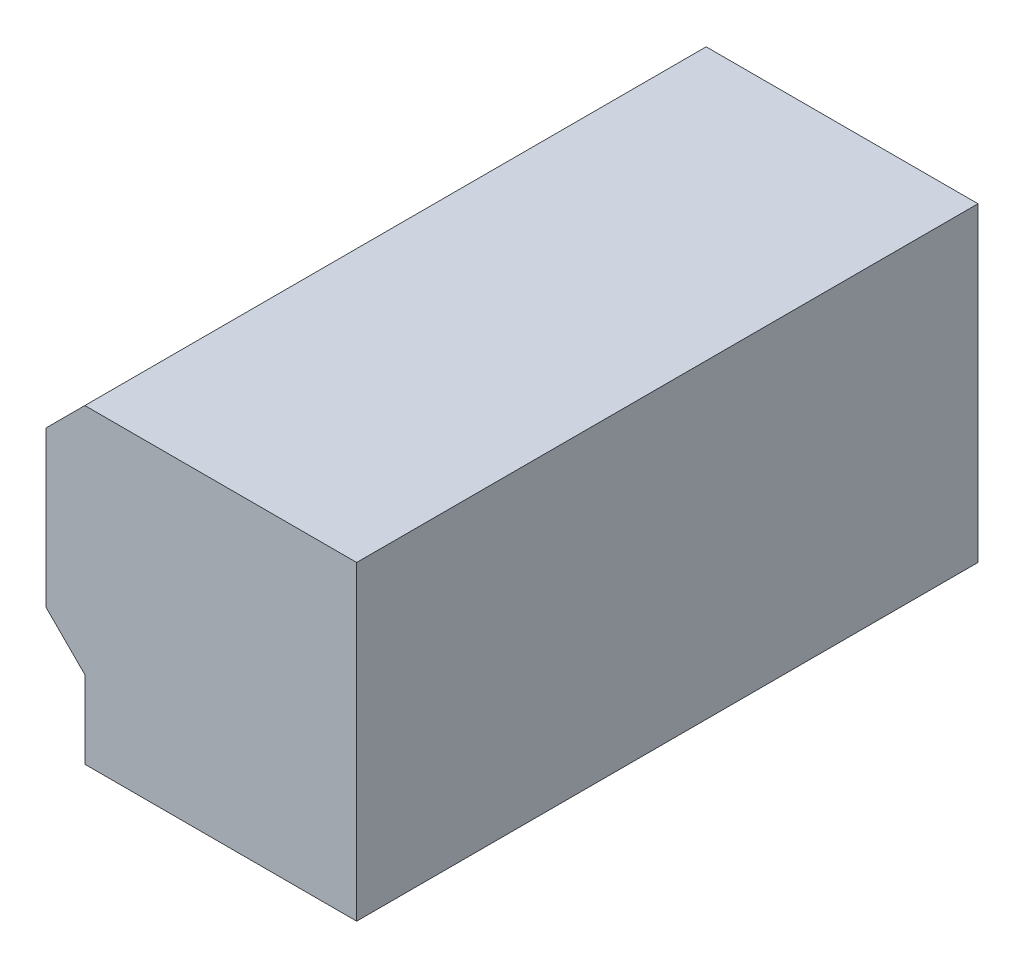
ISO-10303-21;
HEADER;
FILE_DESCRIPTION(('STEP AP214'),'2;1');
FILE_NAME('part.step','',(''),(''),'','','');
FILE_SCHEMA(('AUTOMOTIVE_DESIGN { 1 0 10303 214 1 1 1 1 }'));
ENDSEC;
DATA;
#1=APPLICATION_CONTEXT('core data for automotive mechanical design processes');
#2=APPLICATION_PROTOCOL_DEFINITION('international standard','automotive_design',2000,#1);
#3=PRODUCT_CONTEXT('',#1,'mechanical');
#4=PRODUCT('Part','Part','',(#3));
#5=PRODUCT_RELATED_PRODUCT_CATEGORY('part','',(#4));
#6=PRODUCT_DEFINITION_FORMATION('','',#4);
#7=PRODUCT_DEFINITION_CONTEXT('part definition',#1,'design');
#8=PRODUCT_DEFINITION('design','',#6,#7);
#9=PRODUCT_DEFINITION_SHAPE('','',#8);
#10=(LENGTH_UNIT() NAMED_UNIT(*) SI_UNIT(.MILLI.,.METRE.));
#11=(NAMED_UNIT(*) PLANE_ANGLE_UNIT() SI_UNIT($,.RADIAN.));
#12=(NAMED_UNIT(*) SI_UNIT($,.STERADIAN.) SOLID_ANGLE_UNIT());
#13=UNCERTAINTY_MEASURE_WITH_UNIT(LENGTH_MEASURE(1.E-05),#10,'distance_accuracy_value','');
#14=(GEOMETRIC_REPRESENTATION_CONTEXT(3) GLOBAL_UNCERTAINTY_ASSIGNED_CONTEXT((#13)) GLOBAL_UNIT_ASSIGNED_CONTEXT((#10,
#11,#12)) REPRESENTATION_CONTEXT('',''));
#15=CARTESIAN_POINT('',(0.,0.,0.));
#16=DIRECTION('',(0.,0.,1.));
#17=DIRECTION('',(1.,0.,0.));
#18=AXIS2_PLACEMENT_3D('',#15,#16,#17);
#19=CARTESIAN_POINT('',(-1.00000054,-0.2499995,0.));
#20=DIRECTION('',(-1.,0.,0.));
#21=DIRECTION('',(0.,0.,1.));
#22=AXIS2_PLACEMENT_3D('',#19,#20,#21);
#23=PLANE('',#22);
#24=DIRECTION('',(0.,0.,1.));
#25=VECTOR('',#24,1.);
#26=CARTESIAN_POINT('',(-1.00000054,0.75000104,0.));
#27=LINE('',#26,#25);
#28=CARTESIAN_POINT('',(-1.00000054,0.75000104,0.));
#29=VERTEX_POINT('',#28);
#30=CARTESIAN_POINT('',(-1.00000054,0.75000104,3.99999962));
#31=VERTEX_POINT('',#30);
#32=EDGE_CURVE('E98',#29,#31,#27,.T.);
#33=ORIENTED_EDGE('',*,*,#32,.F.);
#34=DIRECTION('',(0.,1.,0.));
#35=VECTOR('',#34,1.);
#36=CARTESIAN_POINT('',(-1.00000054,-0.2499995,0.));
#37=LINE('',#36,#35);
#38=CARTESIAN_POINT('',(-1.00000054,-0.2499995,0.));
#39=VERTEX_POINT('',#38);
#40=EDGE_CURVE('E74',#29,#39,#37,.F.);
#41=ORIENTED_EDGE('',*,*,#40,.T.);
#42=DIRECTION('',(0.,0.,1.));
#43=VECTOR('',#42,1.);
#44=CARTESIAN_POINT('',(-1.00000054,-0.2499995,0.));
#45=LINE('',#44,#43);
#46=CARTESIAN_POINT('',(-1.00000054,-0.2499995,3.99999962));
#47=VERTEX_POINT('',#46);
#48=EDGE_CURVE('E87',#47,#39,#45,.F.);
#49=ORIENTED_EDGE('',*,*,#48,.F.);
#50=DIRECTION('',(0.,1.,0.));
#51=VECTOR('',#50,1.);
#52=CARTESIAN_POINT('',(-1.00000054,-0.2499995,3.99999962));
#53=LINE('',#52,#51);
#54=EDGE_CURVE('E20',#47,#31,#53,.T.);
#55=ORIENTED_EDGE('',*,*,#54,.T.);
#56=EDGE_LOOP('',(#33,#41,#49,#55));
#57=FACE_BOUND('',#56,.T.);
#58=ADVANCED_FACE('F17',(#57),#23,.T.);
#59=CARTESIAN_POINT('',(-0.75000104,-0.499999,0.));
#60=DIRECTION('',(-0.707106781186548,-0.707106781186548,0.));
#61=DIRECTION('',(0.707106781186548,-0.707106781186548,0.));
#62=AXIS2_PLACEMENT_3D('',#59,#60,#61);
#63=PLANE('',#62);
#64=ORIENTED_EDGE('',*,*,#48,.T.);
#65=DIRECTION('',(0.707106781186548,-0.707106781186548,0.));
#66=VECTOR('',#65,1.);
#67=CARTESIAN_POINT('',(-0.75000104,-0.499999,0.));
#68=LINE('',#67,#66);
#69=CARTESIAN_POINT('',(-0.75000104,-0.499999,0.));
#70=VERTEX_POINT('',#69);
#71=EDGE_CURVE('E89',#39,#70,#68,.T.);
#72=ORIENTED_EDGE('',*,*,#71,.T.);
#73=DIRECTION('',(0.,0.,1.));
#74=VECTOR('',#73,1.);
#75=CARTESIAN_POINT('',(-0.75000104,-0.499999,0.));
#76=LINE('',#75,#74);
#77=CARTESIAN_POINT('',(-0.75000104,-0.499999,3.99999962));
#78=VERTEX_POINT('',#77);
#79=EDGE_CURVE('E93',#78,#70,#76,.F.);
#80=ORIENTED_EDGE('',*,*,#79,.F.);
#81=DIRECTION('',(0.707106781186548,-0.707106781186548,0.));
#82=VECTOR('',#81,1.);
#83=CARTESIAN_POINT('',(-0.75000104,-0.499999,3.99999962));
#84=LINE('',#83,#82);
#85=EDGE_CURVE('E81',#78,#47,#84,.F.);
#86=ORIENTED_EDGE('',*,*,#85,.T.);
#87=EDGE_LOOP('',(#64,#72,#80,#86));
#88=FACE_BOUND('',#87,.T.);
#89=ADVANCED_FACE('F91',(#88),#63,.T.);
#90=CARTESIAN_POINT('',(-1.00000054,0.75000104,0.));
#91=DIRECTION('',(-0.707106781186548,0.707106781186548,0.));
#92=DIRECTION('',(-0.707106781186548,-0.707106781186548,0.));
#93=AXIS2_PLACEMENT_3D('',#90,#91,#92);
#94=PLANE('',#93);
#95=DIRECTION('',(0.,0.,1.));
#96=VECTOR('',#95,1.);
#97=CARTESIAN_POINT('',(-0.75000104,1.00000054,0.));
#98=LINE('',#97,#96);
#99=CARTESIAN_POINT('',(-0.75000104,1.00000054,0.));
#100=VERTEX_POINT('',#99);
#101=CARTESIAN_POINT('',(-0.75000104,1.00000054,3.99999962));
#102=VERTEX_POINT('',#101);
#103=EDGE_CURVE('E107',#100,#102,#98,.T.);
#104=ORIENTED_EDGE('',*,*,#103,.F.);
#105=DIRECTION('',(-0.707106781186548,-0.707106781186548,0.));
#106=VECTOR('',#105,1.);
#107=CARTESIAN_POINT('',(-1.00000054,0.75000104,0.));
#108=LINE('',#107,#106);
#109=EDGE_CURVE('E101',#100,#29,#108,.T.);
#110=ORIENTED_EDGE('',*,*,#109,.T.);
#111=ORIENTED_EDGE('',*,*,#32,.T.);
#112=DIRECTION('',(-0.707106781186548,-0.707106781186548,0.));
#113=VECTOR('',#112,1.);
#114=CARTESIAN_POINT('',(-1.00000054,0.75000104,3.99999962));
#115=LINE('',#114,#113);
#116=EDGE_CURVE('E84',#31,#102,#115,.F.);
#117=ORIENTED_EDGE('',*,*,#116,.T.);
#118=EDGE_LOOP('',(#104,#110,#111,#117));
#119=FACE_BOUND('',#118,.T.);
#120=ADVANCED_FACE('F145',(#119),#94,.T.);
#121=CARTESIAN_POINT('',(-0.75000104,-0.999998,0.));
#122=DIRECTION('',(-1.,0.,0.));
#123=DIRECTION('',(0.,0.,1.));
#124=AXIS2_PLACEMENT_3D('',#121,#122,#123);
#125=PLANE('',#124);
#126=ORIENTED_EDGE('',*,*,#79,.T.);
#127=DIRECTION('',(0.,1.,0.));
#128=VECTOR('',#127,1.);
#129=CARTESIAN_POINT('',(-0.75000104,-0.999998,0.));
#130=LINE('',#129,#128);
#131=CARTESIAN_POINT('',(-0.75000104,-0.999998,0.));
#132=VERTEX_POINT('',#131);
#133=EDGE_CURVE('E105',#70,#132,#130,.F.);
#134=ORIENTED_EDGE('',*,*,#133,.T.);
#135=DIRECTION('',(0.,0.,-1.));
#136=VECTOR('',#135,1.);
#137=CARTESIAN_POINT('',(-0.75000104,-0.999998,0.));
#138=LINE('',#137,#136);
#139=CARTESIAN_POINT('',(-0.75000104,-0.999998,3.99999962));
#140=VERTEX_POINT('',#139);
#141=EDGE_CURVE('E117',#140,#132,#138,.T.);
#142=ORIENTED_EDGE('',*,*,#141,.F.);
#143=DIRECTION('',(0.,1.,0.));
#144=VECTOR('',#143,1.);
#145=CARTESIAN_POINT('',(-0.75000104,1.00000054,3.99999962));
#146=LINE('',#145,#144);
#147=EDGE_CURVE('E112',#78,#140,#146,.F.);
#148=ORIENTED_EDGE('',*,*,#147,.F.);
#149=EDGE_LOOP('',(#126,#134,#142,#148));
#150=FACE_BOUND('',#149,.T.);
#151=ADVANCED_FACE('F136',(#150),#125,.T.);
#152=CARTESIAN_POINT('',(-0.75000104,1.00000054,0.));
#153=DIRECTION('',(0.,1.,0.));
#154=DIRECTION('',(0.,0.,1.));
#155=AXIS2_PLACEMENT_3D('',#152,#153,#154);
#156=PLANE('',#155);
#157=DIRECTION('',(0.,0.,-1.));
#158=VECTOR('',#157,1.);
#159=CARTESIAN_POINT('',(1.00000054,1.00000054,0.));
#160=LINE('',#159,#158);
#161=CARTESIAN_POINT('',(1.00000054,1.00000054,0.));
#162=VERTEX_POINT('',#161);
#163=CARTESIAN_POINT('',(1.00000054,1.00000054,3.99999962));
#164=VERTEX_POINT('',#163);
#165=EDGE_CURVE('E123',#162,#164,#160,.F.);
#166=ORIENTED_EDGE('',*,*,#165,.F.);
#167=DIRECTION('',(1.,0.,0.));
#168=VECTOR('',#167,1.);
#169=CARTESIAN_POINT('',(1.00000054,1.00000054,0.));
#170=LINE('',#169,#168);
#171=EDGE_CURVE('E119',#162,#100,#170,.F.);
#172=ORIENTED_EDGE('',*,*,#171,.T.);
#173=ORIENTED_EDGE('',*,*,#103,.T.);
#174=DIRECTION('',(1.,0.,0.));
#175=VECTOR('',#174,1.);
#176=CARTESIAN_POINT('',(1.00000054,1.00000054,3.99999962));
#177=LINE('',#176,#175);
#178=EDGE_CURVE('E110',#164,#102,#177,.F.);
#179=ORIENTED_EDGE('',*,*,#178,.F.);
#180=EDGE_LOOP('',(#166,#172,#173,#179));
#181=FACE_BOUND('',#180,.T.);
#182=ADVANCED_FACE('F143',(#181),#156,.T.);
#183=CARTESIAN_POINT('',(1.00000054,1.00000054,3.99999962));
#184=DIRECTION('',(0.,0.,1.));
#185=DIRECTION('',(1.,0.,0.));
#186=AXIS2_PLACEMENT_3D('',#183,#184,#185);
#187=PLANE('',#186);
#188=DIRECTION('',(1.,0.,0.));
#189=VECTOR('',#188,1.);
#190=CARTESIAN_POINT('',(1.00000054,-0.999998,3.99999962));
#191=LINE('',#190,#189);
#192=CARTESIAN_POINT('',(1.00000054,-0.999998,3.99999962));
#193=VERTEX_POINT('',#192);
#194=EDGE_CURVE('E114',#193,#140,#191,.F.);
#195=ORIENTED_EDGE('',*,*,#194,.F.);
#196=DIRECTION('',(0.,1.,0.));
#197=VECTOR('',#196,1.);
#198=CARTESIAN_POINT('',(1.00000054,1.00000054,3.99999962));
#199=LINE('',#198,#197);
#200=EDGE_CURVE('E126',#164,#193,#199,.F.);
#201=ORIENTED_EDGE('',*,*,#200,.F.);
#202=ORIENTED_EDGE('',*,*,#178,.T.);
#203=ORIENTED_EDGE('',*,*,#116,.F.);
#204=ORIENTED_EDGE('',*,*,#54,.F.);
#205=ORIENTED_EDGE('',*,*,#85,.F.);
#206=ORIENTED_EDGE('',*,*,#147,.T.);
#207=EDGE_LOOP('',(#195,#201,#202,#203,#204,#205,#206));
#208=FACE_BOUND('',#207,.T.);
#209=ADVANCED_FACE('F79',(#208),#187,.T.);
#210=CARTESIAN_POINT('',(1.00000054,-0.999998,0.));
#211=DIRECTION('',(0.,-1.,0.));
#212=DIRECTION('',(0.,0.,-1.));
#213=AXIS2_PLACEMENT_3D('',#210,#211,#212);
#214=PLANE('',#213);
#215=ORIENTED_EDGE('',*,*,#141,.T.);
#216=DIRECTION('',(1.,0.,0.));
#217=VECTOR('',#216,1.);
#218=CARTESIAN_POINT('',(1.00000054,-0.999998,0.));
#219=LINE('',#218,#217);
#220=CARTESIAN_POINT('',(1.00000054,-0.999998,0.));
#221=VERTEX_POINT('',#220);
#222=EDGE_CURVE('E35',#132,#221,#219,.T.);
#223=ORIENTED_EDGE('',*,*,#222,.T.);
#224=DIRECTION('',(0.,0.,-1.));
#225=VECTOR('',#224,1.);
#226=CARTESIAN_POINT('',(1.00000054,-0.999998,0.));
#227=LINE('',#226,#225);
#228=EDGE_CURVE('E26',#193,#221,#227,.T.);
#229=ORIENTED_EDGE('',*,*,#228,.F.);
#230=ORIENTED_EDGE('',*,*,#194,.T.);
#231=EDGE_LOOP('',(#215,#223,#229,#230));
#232=FACE_BOUND('',#231,.T.);
#233=ADVANCED_FACE('F133',(#232),#214,.T.);
#234=CARTESIAN_POINT('',(1.00000054,1.00000054,0.));
#235=DIRECTION('',(0.,0.,1.));
#236=DIRECTION('',(1.,0.,0.));
#237=AXIS2_PLACEMENT_3D('',#234,#235,#236);
#238=PLANE('',#237);
#239=ORIENTED_EDGE('',*,*,#222,.F.);
#240=ORIENTED_EDGE('',*,*,#133,.F.);
#241=ORIENTED_EDGE('',*,*,#71,.F.);
#242=ORIENTED_EDGE('',*,*,#40,.F.);
#243=ORIENTED_EDGE('',*,*,#109,.F.);
#244=ORIENTED_EDGE('',*,*,#171,.F.);
#245=DIRECTION('',(0.,1.,0.));
#246=VECTOR('',#245,1.);
#247=CARTESIAN_POINT('',(1.00000054,1.00000054,0.));
#248=LINE('',#247,#246);
#249=EDGE_CURVE('E11',#221,#162,#248,.T.);
#250=ORIENTED_EDGE('',*,*,#249,.F.);
#251=EDGE_LOOP('',(#239,#240,#241,#242,#243,#244,#250));
#252=FACE_BOUND('',#251,.T.);
#253=ADVANCED_FACE('F139',(#252),#238,.F.);
#254=CARTESIAN_POINT('',(1.00000054,1.00000054,0.));
#255=DIRECTION('',(1.,0.,0.));
#256=DIRECTION('',(0.,0.,-1.));
#257=AXIS2_PLACEMENT_3D('',#254,#255,#256);
#258=PLANE('',#257);
#259=ORIENTED_EDGE('',*,*,#228,.T.);
#260=ORIENTED_EDGE('',*,*,#249,.T.);
#261=ORIENTED_EDGE('',*,*,#165,.T.);
#262=ORIENTED_EDGE('',*,*,#200,.T.);
#263=EDGE_LOOP('',(#259,#260,#261,#262));
#264=FACE_BOUND('',#263,.T.);
#265=ADVANCED_FACE('F131',(#264),#258,.T.);
#266=CLOSED_SHELL('',(#58,#89,#120,#151,#182,#209,#233,#253,#265));
#267=MANIFOLD_SOLID_BREP('B1',#266);
#268=ADVANCED_BREP_SHAPE_REPRESENTATION('',(#18,#267),#14);
#269=SHAPE_DEFINITION_REPRESENTATION(#9,#268);
ENDSEC;
END-ISO-10303-21;
